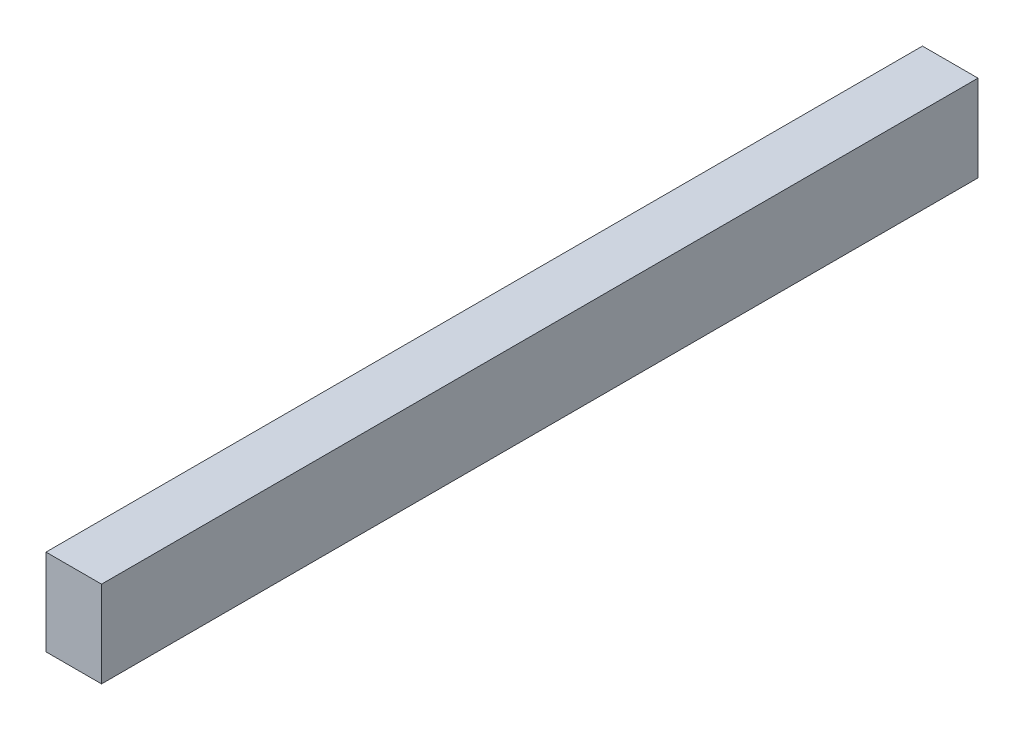
ISO-10303-21;
HEADER;
FILE_DESCRIPTION(('STEP AP214'),'2;1');
FILE_NAME('part.step','',(''),(''),'','','');
FILE_SCHEMA(('AUTOMOTIVE_DESIGN { 1 0 10303 214 1 1 1 1 }'));
ENDSEC;
DATA;
#1=APPLICATION_CONTEXT('core data for automotive mechanical design processes');
#2=APPLICATION_PROTOCOL_DEFINITION('international standard','automotive_design',2000,#1);
#3=PRODUCT_CONTEXT('',#1,'mechanical');
#4=PRODUCT('Part','Part','',(#3));
#5=PRODUCT_RELATED_PRODUCT_CATEGORY('part','',(#4));
#6=PRODUCT_DEFINITION_FORMATION('','',#4);
#7=PRODUCT_DEFINITION_CONTEXT('part definition',#1,'design');
#8=PRODUCT_DEFINITION('design','',#6,#7);
#9=PRODUCT_DEFINITION_SHAPE('','',#8);
#10=(LENGTH_UNIT() NAMED_UNIT(*) SI_UNIT(.MILLI.,.METRE.));
#11=(NAMED_UNIT(*) PLANE_ANGLE_UNIT() SI_UNIT($,.RADIAN.));
#12=(NAMED_UNIT(*) SI_UNIT($,.STERADIAN.) SOLID_ANGLE_UNIT());
#13=UNCERTAINTY_MEASURE_WITH_UNIT(LENGTH_MEASURE(1.E-05),#10,'distance_accuracy_value','');
#14=(GEOMETRIC_REPRESENTATION_CONTEXT(3) GLOBAL_UNCERTAINTY_ASSIGNED_CONTEXT((#13)) GLOBAL_UNIT_ASSIGNED_CONTEXT((#10,
#11,#12)) REPRESENTATION_CONTEXT('',''));
#15=CARTESIAN_POINT('',(0.,0.,0.));
#16=DIRECTION('',(0.,0.,1.));
#17=DIRECTION('',(1.,0.,0.));
#18=AXIS2_PLACEMENT_3D('',#15,#16,#17);
#19=CARTESIAN_POINT('',(0.,0.,710.));
#20=DIRECTION('',(1.,0.,0.));
#21=DIRECTION('',(0.,1.,0.));
#22=AXIS2_PLACEMENT_3D('',#19,#20,#21);
#23=PLANE('',#22);
#24=DIRECTION('',(0.,-1.,0.));
#25=VECTOR('',#24,1.);
#26=CARTESIAN_POINT('',(0.,0.,0.));
#27=LINE('',#26,#25);
#28=CARTESIAN_POINT('',(0.,0.,0.));
#29=VERTEX_POINT('',#28);
#30=CARTESIAN_POINT('',(0.,-70.,0.));
#31=VERTEX_POINT('',#30);
#32=EDGE_CURVE('E96',#29,#31,#27,.T.);
#33=ORIENTED_EDGE('',*,*,#32,.T.);
#34=DIRECTION('',(0.,0.,-1.));
#35=VECTOR('',#34,1.);
#36=CARTESIAN_POINT('',(0.,-70.,710.));
#37=LINE('',#36,#35);
#38=CARTESIAN_POINT('',(0.,-70.,710.));
#39=VERTEX_POINT('',#38);
#40=EDGE_CURVE('E11',#39,#31,#37,.T.);
#41=ORIENTED_EDGE('',*,*,#40,.F.);
#42=DIRECTION('',(0.,-1.,0.));
#43=VECTOR('',#42,1.);
#44=CARTESIAN_POINT('',(0.,0.,710.));
#45=LINE('',#44,#43);
#46=CARTESIAN_POINT('',(0.,0.,710.));
#47=VERTEX_POINT('',#46);
#48=EDGE_CURVE('E84',#47,#39,#45,.T.);
#49=ORIENTED_EDGE('',*,*,#48,.F.);
#50=DIRECTION('',(0.,0.,-1.));
#51=VECTOR('',#50,1.);
#52=CARTESIAN_POINT('',(0.,0.,710.));
#53=LINE('',#52,#51);
#54=EDGE_CURVE('E92',#47,#29,#53,.T.);
#55=ORIENTED_EDGE('',*,*,#54,.T.);
#56=EDGE_LOOP('',(#33,#41,#49,#55));
#57=FACE_BOUND('',#56,.T.);
#58=ADVANCED_FACE('F33',(#57),#23,.F.);
#59=CARTESIAN_POINT('',(0.,-70.,710.));
#60=DIRECTION('',(0.,1.,0.));
#61=DIRECTION('',(0.,0.,1.));
#62=AXIS2_PLACEMENT_3D('',#59,#60,#61);
#63=PLANE('',#62);
#64=DIRECTION('',(1.,0.,0.));
#65=VECTOR('',#64,1.);
#66=CARTESIAN_POINT('',(0.,-70.,0.));
#67=LINE('',#66,#65);
#68=CARTESIAN_POINT('',(45.,-70.,0.));
#69=VERTEX_POINT('',#68);
#70=EDGE_CURVE('E88',#31,#69,#67,.T.);
#71=ORIENTED_EDGE('',*,*,#70,.T.);
#72=DIRECTION('',(0.,0.,-1.));
#73=VECTOR('',#72,1.);
#74=CARTESIAN_POINT('',(45.,-70.,710.));
#75=LINE('',#74,#73);
#76=CARTESIAN_POINT('',(45.,-70.,710.));
#77=VERTEX_POINT('',#76);
#78=EDGE_CURVE('E41',#77,#69,#75,.T.);
#79=ORIENTED_EDGE('',*,*,#78,.F.);
#80=DIRECTION('',(1.,0.,0.));
#81=VECTOR('',#80,1.);
#82=CARTESIAN_POINT('',(0.,-70.,710.));
#83=LINE('',#82,#81);
#84=EDGE_CURVE('E79',#39,#77,#83,.T.);
#85=ORIENTED_EDGE('',*,*,#84,.F.);
#86=ORIENTED_EDGE('',*,*,#40,.T.);
#87=EDGE_LOOP('',(#71,#79,#85,#86));
#88=FACE_BOUND('',#87,.T.);
#89=ADVANCED_FACE('F87',(#88),#63,.F.);
#90=CARTESIAN_POINT('',(45.,0.,710.));
#91=DIRECTION('',(-1.,0.,0.));
#92=DIRECTION('',(0.,-1.,0.));
#93=AXIS2_PLACEMENT_3D('',#90,#91,#92);
#94=PLANE('',#93);
#95=DIRECTION('',(0.,1.,0.));
#96=VECTOR('',#95,1.);
#97=CARTESIAN_POINT('',(45.,0.,0.));
#98=LINE('',#97,#96);
#99=CARTESIAN_POINT('',(45.,0.,0.));
#100=VERTEX_POINT('',#99);
#101=EDGE_CURVE('E66',#69,#100,#98,.T.);
#102=ORIENTED_EDGE('',*,*,#101,.T.);
#103=DIRECTION('',(0.,0.,-1.));
#104=VECTOR('',#103,1.);
#105=CARTESIAN_POINT('',(45.,0.,710.));
#106=LINE('',#105,#104);
#107=CARTESIAN_POINT('',(45.,0.,710.));
#108=VERTEX_POINT('',#107);
#109=EDGE_CURVE('E89',#108,#100,#106,.T.);
#110=ORIENTED_EDGE('',*,*,#109,.F.);
#111=DIRECTION('',(0.,1.,0.));
#112=VECTOR('',#111,1.);
#113=CARTESIAN_POINT('',(45.,0.,710.));
#114=LINE('',#113,#112);
#115=EDGE_CURVE('E82',#77,#108,#114,.T.);
#116=ORIENTED_EDGE('',*,*,#115,.F.);
#117=ORIENTED_EDGE('',*,*,#78,.T.);
#118=EDGE_LOOP('',(#102,#110,#116,#117));
#119=FACE_BOUND('',#118,.T.);
#120=ADVANCED_FACE('F90',(#119),#94,.F.);
#121=CARTESIAN_POINT('',(0.,0.,710.));
#122=DIRECTION('',(0.,-1.,0.));
#123=DIRECTION('',(0.,0.,-1.));
#124=AXIS2_PLACEMENT_3D('',#121,#122,#123);
#125=PLANE('',#124);
#126=DIRECTION('',(-1.,0.,0.));
#127=VECTOR('',#126,1.);
#128=CARTESIAN_POINT('',(0.,0.,0.));
#129=LINE('',#128,#127);
#130=EDGE_CURVE('E72',#100,#29,#129,.T.);
#131=ORIENTED_EDGE('',*,*,#130,.T.);
#132=ORIENTED_EDGE('',*,*,#54,.F.);
#133=DIRECTION('',(-1.,0.,0.));
#134=VECTOR('',#133,1.);
#135=CARTESIAN_POINT('',(0.,0.,710.));
#136=LINE('',#135,#134);
#137=EDGE_CURVE('E49',#108,#47,#136,.T.);
#138=ORIENTED_EDGE('',*,*,#137,.F.);
#139=ORIENTED_EDGE('',*,*,#109,.T.);
#140=EDGE_LOOP('',(#131,#132,#138,#139));
#141=FACE_BOUND('',#140,.T.);
#142=ADVANCED_FACE('F103',(#141),#125,.F.);
#143=CARTESIAN_POINT('',(0.,0.,710.));
#144=DIRECTION('',(0.,0.,1.));
#145=DIRECTION('',(1.,0.,0.));
#146=AXIS2_PLACEMENT_3D('',#143,#144,#145);
#147=PLANE('',#146);
#148=ORIENTED_EDGE('',*,*,#48,.T.);
#149=ORIENTED_EDGE('',*,*,#84,.T.);
#150=ORIENTED_EDGE('',*,*,#115,.T.);
#151=ORIENTED_EDGE('',*,*,#137,.T.);
#152=EDGE_LOOP('',(#148,#149,#150,#151));
#153=FACE_BOUND('',#152,.T.);
#154=ADVANCED_FACE('F80',(#153),#147,.T.);
#155=CARTESIAN_POINT('',(0.,0.,0.));
#156=DIRECTION('',(0.,0.,1.));
#157=DIRECTION('',(1.,0.,0.));
#158=AXIS2_PLACEMENT_3D('',#155,#156,#157);
#159=PLANE('',#158);
#160=ORIENTED_EDGE('',*,*,#32,.F.);
#161=ORIENTED_EDGE('',*,*,#130,.F.);
#162=ORIENTED_EDGE('',*,*,#101,.F.);
#163=ORIENTED_EDGE('',*,*,#70,.F.);
#164=EDGE_LOOP('',(#160,#161,#162,#163));
#165=FACE_BOUND('',#164,.T.);
#166=ADVANCED_FACE('F106',(#165),#159,.F.);
#167=CLOSED_SHELL('',(#58,#89,#120,#142,#154,#166));
#168=MANIFOLD_SOLID_BREP('B2',#167);
#169=ADVANCED_BREP_SHAPE_REPRESENTATION('',(#18,#168),#14);
#170=SHAPE_DEFINITION_REPRESENTATION(#9,#169);
ENDSEC;
END-ISO-10303-21;
